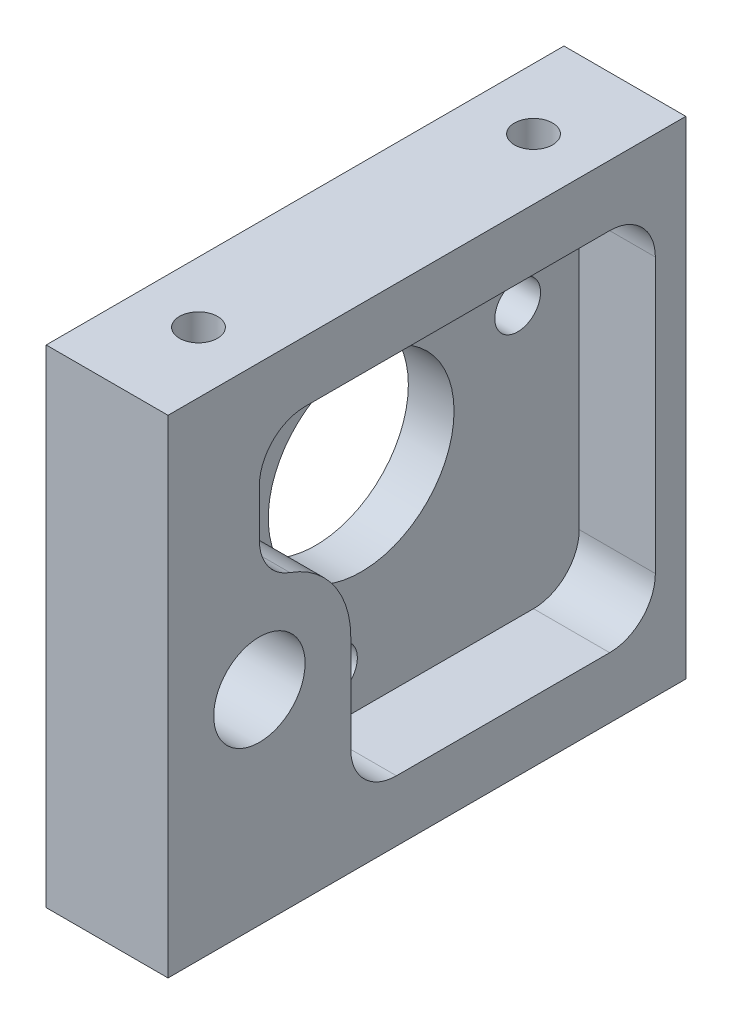
ISO-10303-21;
HEADER;
FILE_DESCRIPTION(('STEP AP214'),'2;1');
FILE_NAME('part.step','',(''),(''),'','','');
FILE_SCHEMA(('AUTOMOTIVE_DESIGN { 1 0 10303 214 1 1 1 1 }'));
ENDSEC;
DATA;
#1=APPLICATION_CONTEXT('core data for automotive mechanical design processes');
#2=APPLICATION_PROTOCOL_DEFINITION('international standard','automotive_design',2000,#1);
#3=PRODUCT_CONTEXT('',#1,'mechanical');
#4=PRODUCT('Part','Part','',(#3));
#5=PRODUCT_RELATED_PRODUCT_CATEGORY('part','',(#4));
#6=PRODUCT_DEFINITION_FORMATION('','',#4);
#7=PRODUCT_DEFINITION_CONTEXT('part definition',#1,'design');
#8=PRODUCT_DEFINITION('design','',#6,#7);
#9=PRODUCT_DEFINITION_SHAPE('','',#8);
#10=(LENGTH_UNIT() NAMED_UNIT(*) SI_UNIT(.MILLI.,.METRE.));
#11=(NAMED_UNIT(*) PLANE_ANGLE_UNIT() SI_UNIT($,.RADIAN.));
#12=(NAMED_UNIT(*) SI_UNIT($,.STERADIAN.) SOLID_ANGLE_UNIT());
#13=UNCERTAINTY_MEASURE_WITH_UNIT(LENGTH_MEASURE(1.E-05),#10,'distance_accuracy_value','');
#14=(GEOMETRIC_REPRESENTATION_CONTEXT(3) GLOBAL_UNCERTAINTY_ASSIGNED_CONTEXT((#13)) GLOBAL_UNIT_ASSIGNED_CONTEXT((#10,
#11,#12)) REPRESENTATION_CONTEXT('',''));
#15=CARTESIAN_POINT('',(0.,0.,0.));
#16=DIRECTION('',(0.,0.,1.));
#17=DIRECTION('',(1.,0.,0.));
#18=AXIS2_PLACEMENT_3D('',#15,#16,#17);
#19=CARTESIAN_POINT('',(-0.000999999999999265,6.98982565886287,-15.9327571658744));
#20=DIRECTION('',(1.,0.,0.));
#21=DIRECTION('',(0.,-0.866025403784443,0.499999999999992));
#22=AXIS2_PLACEMENT_3D('',#19,#20,#21);
#23=CYLINDRICAL_SURFACE('',#22,1.50000000000001);
#24=CARTESIAN_POINT('',(0.,6.98982565886287,-15.9327571658744));
#25=DIRECTION('',(-1.,0.,0.));
#26=DIRECTION('',(0.,0.866025403784443,-0.499999999999992));
#27=AXIS2_PLACEMENT_3D('',#24,#25,#26);
#28=CIRCLE('',#27,1.50000000000001);
#29=CARTESIAN_POINT('',(0.,8.28886376453955,-16.6827571658744));
#30=VERTEX_POINT('',#29);
#31=EDGE_CURVE('E11',#30,#30,#28,.F.);
#32=ORIENTED_EDGE('',*,*,#31,.F.);
#33=EDGE_LOOP('',(#32));
#34=FACE_BOUND('',#33,.T.);
#35=CARTESIAN_POINT('',(3.,6.98982565886287,-15.9327571658744));
#36=DIRECTION('',(1.,0.,0.));
#37=DIRECTION('',(0.,0.,-1.));
#38=AXIS2_PLACEMENT_3D('',#35,#36,#37);
#39=CIRCLE('',#38,1.50000000000001);
#40=CARTESIAN_POINT('',(3.,6.98982565886287,-17.4327571658744));
#41=VERTEX_POINT('',#40);
#42=EDGE_CURVE('E289',#41,#41,#39,.F.);
#43=ORIENTED_EDGE('',*,*,#42,.F.);
#44=EDGE_LOOP('',(#43));
#45=FACE_BOUND('',#44,.T.);
#46=ADVANCED_FACE('F37',(#34,#45),#23,.F.);
#47=CARTESIAN_POINT('',(-0.000999999999999265,24.7941743411371,-9.15004620343456));
#48=DIRECTION('',(1.,0.,0.));
#49=DIRECTION('',(0.,0.866025403784436,0.500000000000004));
#50=AXIS2_PLACEMENT_3D('',#47,#48,#49);
#51=CYLINDRICAL_SURFACE('',#50,1.50000000000001);
#52=CARTESIAN_POINT('',(0.,24.7941743411371,-9.15004620343456));
#53=DIRECTION('',(-1.,0.,0.));
#54=DIRECTION('',(0.,-0.866025403784436,-0.500000000000004));
#55=AXIS2_PLACEMENT_3D('',#52,#53,#54);
#56=CIRCLE('',#55,1.50000000000001);
#57=CARTESIAN_POINT('',(0.,23.4951362354604,-9.90004620343457));
#58=VERTEX_POINT('',#57);
#59=EDGE_CURVE('E45',#58,#58,#56,.F.);
#60=ORIENTED_EDGE('',*,*,#59,.F.);
#61=EDGE_LOOP('',(#60));
#62=FACE_BOUND('',#61,.T.);
#63=CARTESIAN_POINT('',(3.,24.7941743411371,-9.15004620343456));
#64=DIRECTION('',(1.,0.,0.));
#65=DIRECTION('',(0.,0.,-1.));
#66=AXIS2_PLACEMENT_3D('',#63,#64,#65);
#67=CIRCLE('',#66,1.50000000000001);
#68=CARTESIAN_POINT('',(3.,24.7941743411371,-10.6500462034346));
#69=VERTEX_POINT('',#68);
#70=EDGE_CURVE('E286',#69,#69,#67,.F.);
#71=ORIENTED_EDGE('',*,*,#70,.F.);
#72=EDGE_LOOP('',(#71));
#73=FACE_BOUND('',#72,.T.);
#74=ADVANCED_FACE('F333',(#62,#73),#51,.F.);
#75=CARTESIAN_POINT('',(-0.000999999999999265,17.85,-17.6810744368829));
#76=DIRECTION('',(1.,0.,0.));
#77=DIRECTION('',(0.,0.,-1.));
#78=AXIS2_PLACEMENT_3D('',#75,#76,#77);
#79=CYLINDRICAL_SURFACE('',#78,6.10000000000001);
#80=CARTESIAN_POINT('',(0.,17.85,-17.6810744368829));
#81=DIRECTION('',(-1.,0.,0.));
#82=DIRECTION('',(0.,0.,1.));
#83=AXIS2_PLACEMENT_3D('',#80,#81,#82);
#84=CIRCLE('',#83,6.10000000000001);
#85=CARTESIAN_POINT('',(0.,17.85,-11.5810744368829));
#86=VERTEX_POINT('',#85);
#87=EDGE_CURVE('E299',#86,#86,#84,.F.);
#88=ORIENTED_EDGE('',*,*,#87,.F.);
#89=EDGE_LOOP('',(#88));
#90=FACE_BOUND('',#89,.T.);
#91=CARTESIAN_POINT('',(3.,17.85,-17.6810744368829));
#92=DIRECTION('',(1.,0.,0.));
#93=DIRECTION('',(0.,0.,-1.));
#94=AXIS2_PLACEMENT_3D('',#91,#92,#93);
#95=CIRCLE('',#94,6.10000000000001);
#96=CARTESIAN_POINT('',(3.,17.85,-23.7810744368829));
#97=VERTEX_POINT('',#96);
#98=EDGE_CURVE('E283',#97,#97,#95,.F.);
#99=ORIENTED_EDGE('',*,*,#98,.F.);
#100=EDGE_LOOP('',(#99));
#101=FACE_BOUND('',#100,.T.);
#102=ADVANCED_FACE('F336',(#90,#101),#79,.F.);
#103=CARTESIAN_POINT('',(-0.000999999999999265,21.766,-27.9604199413399));
#104=DIRECTION('',(1.,0.,0.));
#105=DIRECTION('',(0.,0.,-1.));
#106=AXIS2_PLACEMENT_3D('',#103,#104,#105);
#107=CYLINDRICAL_SURFACE('',#106,1.50000000000001);
#108=CARTESIAN_POINT('',(0.,21.766,-27.9604199413399));
#109=DIRECTION('',(-1.,0.,0.));
#110=DIRECTION('',(0.,0.,1.));
#111=AXIS2_PLACEMENT_3D('',#108,#109,#110);
#112=CIRCLE('',#111,1.50000000000001);
#113=CARTESIAN_POINT('',(0.,21.766,-26.4604199413399));
#114=VERTEX_POINT('',#113);
#115=EDGE_CURVE('E292',#114,#114,#112,.F.);
#116=ORIENTED_EDGE('',*,*,#115,.F.);
#117=EDGE_LOOP('',(#116));
#118=FACE_BOUND('',#117,.T.);
#119=CARTESIAN_POINT('',(3.,21.766,-27.9604199413399));
#120=DIRECTION('',(1.,0.,0.));
#121=DIRECTION('',(0.,0.,-1.));
#122=AXIS2_PLACEMENT_3D('',#119,#120,#121);
#123=CIRCLE('',#122,1.50000000000001);
#124=CARTESIAN_POINT('',(3.,21.766,-29.4604199413399));
#125=VERTEX_POINT('',#124);
#126=EDGE_CURVE('E40',#125,#125,#123,.F.);
#127=ORIENTED_EDGE('',*,*,#126,.F.);
#128=EDGE_LOOP('',(#127));
#129=FACE_BOUND('',#128,.T.);
#130=ADVANCED_FACE('F387',(#118,#129),#107,.F.);
#131=CARTESIAN_POINT('',(8.,0.,0.));
#132=DIRECTION('',(0.,0.,-1.));
#133=DIRECTION('',(-1.,0.,0.));
#134=AXIS2_PLACEMENT_3D('',#131,#132,#133);
#135=PLANE('',#134);
#136=DIRECTION('',(0.,-1.,0.));
#137=VECTOR('',#136,1.);
#138=CARTESIAN_POINT('',(0.,0.,0.));
#139=LINE('',#138,#137);
#140=CARTESIAN_POINT('',(0.,32.,0.));
#141=VERTEX_POINT('',#140);
#142=CARTESIAN_POINT('',(0.,0.,0.));
#143=VERTEX_POINT('',#142);
#144=EDGE_CURVE('E304',#141,#143,#139,.T.);
#145=ORIENTED_EDGE('',*,*,#144,.T.);
#146=DIRECTION('',(-1.,0.,0.));
#147=VECTOR('',#146,1.);
#148=CARTESIAN_POINT('',(8.,0.,0.));
#149=LINE('',#148,#147);
#150=CARTESIAN_POINT('',(8.,0.,0.));
#151=VERTEX_POINT('',#150);
#152=EDGE_CURVE('E325',#151,#143,#149,.T.);
#153=ORIENTED_EDGE('',*,*,#152,.F.);
#154=DIRECTION('',(0.,-1.,0.));
#155=VECTOR('',#154,1.);
#156=CARTESIAN_POINT('',(8.,0.,0.));
#157=LINE('',#156,#155);
#158=CARTESIAN_POINT('',(8.,32.,0.));
#159=VERTEX_POINT('',#158);
#160=EDGE_CURVE('E305',#159,#151,#157,.T.);
#161=ORIENTED_EDGE('',*,*,#160,.F.);
#162=DIRECTION('',(-1.,0.,0.));
#163=VECTOR('',#162,1.);
#164=CARTESIAN_POINT('',(8.,32.,0.));
#165=LINE('',#164,#163);
#166=EDGE_CURVE('E311',#159,#141,#165,.T.);
#167=ORIENTED_EDGE('',*,*,#166,.T.);
#168=EDGE_LOOP('',(#145,#153,#161,#167));
#169=FACE_BOUND('',#168,.T.);
#170=ADVANCED_FACE('F384',(#169),#135,.F.);
#171=CARTESIAN_POINT('',(8.,0.,0.));
#172=DIRECTION('',(0.,1.,0.));
#173=DIRECTION('',(0.,0.,1.));
#174=AXIS2_PLACEMENT_3D('',#171,#172,#173);
#175=PLANE('',#174);
#176=CARTESIAN_POINT('',(4.,0.,-6.));
#177=DIRECTION('',(0.,-1.,0.));
#178=DIRECTION('',(0.,0.,-1.));
#179=AXIS2_PLACEMENT_3D('',#176,#177,#178);
#180=CIRCLE('',#179,1.24999999999999);
#181=CARTESIAN_POINT('',(4.,0.,-7.24999999999999));
#182=VERTEX_POINT('',#181);
#183=EDGE_CURVE('E175',#182,#182,#180,.T.);
#184=ORIENTED_EDGE('',*,*,#183,.F.);
#185=EDGE_LOOP('',(#184));
#186=FACE_BOUND('',#185,.T.);
#187=CARTESIAN_POINT('',(4.,0.,-28.));
#188=DIRECTION('',(0.,-1.,0.));
#189=DIRECTION('',(0.,0.,-1.));
#190=AXIS2_PLACEMENT_3D('',#187,#188,#189);
#191=CIRCLE('',#190,1.24999999999999);
#192=CARTESIAN_POINT('',(4.,0.,-29.25));
#193=VERTEX_POINT('',#192);
#194=EDGE_CURVE('E174',#193,#193,#191,.T.);
#195=ORIENTED_EDGE('',*,*,#194,.F.);
#196=EDGE_LOOP('',(#195));
#197=FACE_BOUND('',#196,.T.);
#198=DIRECTION('',(0.,0.,-1.));
#199=VECTOR('',#198,1.);
#200=CARTESIAN_POINT('',(0.,0.,0.));
#201=LINE('',#200,#199);
#202=CARTESIAN_POINT('',(0.,0.,-34.));
#203=VERTEX_POINT('',#202);
#204=EDGE_CURVE('E314',#143,#203,#201,.T.);
#205=ORIENTED_EDGE('',*,*,#204,.T.);
#206=DIRECTION('',(-1.,0.,0.));
#207=VECTOR('',#206,1.);
#208=CARTESIAN_POINT('',(8.,0.,-34.));
#209=LINE('',#208,#207);
#210=CARTESIAN_POINT('',(8.,0.,-34.));
#211=VERTEX_POINT('',#210);
#212=EDGE_CURVE('E322',#211,#203,#209,.T.);
#213=ORIENTED_EDGE('',*,*,#212,.F.);
#214=DIRECTION('',(0.,0.,-1.));
#215=VECTOR('',#214,1.);
#216=CARTESIAN_POINT('',(8.,0.,0.));
#217=LINE('',#216,#215);
#218=EDGE_CURVE('E90',#151,#211,#217,.T.);
#219=ORIENTED_EDGE('',*,*,#218,.F.);
#220=ORIENTED_EDGE('',*,*,#152,.T.);
#221=EDGE_LOOP('',(#205,#213,#219,#220));
#222=FACE_BOUND('',#221,.T.);
#223=ADVANCED_FACE('F380',(#186,#197,#222),#175,.F.);
#224=CARTESIAN_POINT('',(8.,0.,-34.));
#225=DIRECTION('',(0.,0.,1.));
#226=DIRECTION('',(1.,0.,0.));
#227=AXIS2_PLACEMENT_3D('',#224,#225,#226);
#228=PLANE('',#227);
#229=DIRECTION('',(0.,1.,0.));
#230=VECTOR('',#229,1.);
#231=CARTESIAN_POINT('',(0.,0.,-34.));
#232=LINE('',#231,#230);
#233=CARTESIAN_POINT('',(0.,32.,-34.));
#234=VERTEX_POINT('',#233);
#235=EDGE_CURVE('E316',#203,#234,#232,.T.);
#236=ORIENTED_EDGE('',*,*,#235,.T.);
#237=DIRECTION('',(-1.,0.,0.));
#238=VECTOR('',#237,1.);
#239=CARTESIAN_POINT('',(8.,32.,-34.));
#240=LINE('',#239,#238);
#241=CARTESIAN_POINT('',(8.,32.,-34.));
#242=VERTEX_POINT('',#241);
#243=EDGE_CURVE('E320',#242,#234,#240,.T.);
#244=ORIENTED_EDGE('',*,*,#243,.F.);
#245=DIRECTION('',(0.,1.,0.));
#246=VECTOR('',#245,1.);
#247=CARTESIAN_POINT('',(8.,0.,-34.));
#248=LINE('',#247,#246);
#249=EDGE_CURVE('E308',#211,#242,#248,.T.);
#250=ORIENTED_EDGE('',*,*,#249,.F.);
#251=ORIENTED_EDGE('',*,*,#212,.T.);
#252=EDGE_LOOP('',(#236,#244,#250,#251));
#253=FACE_BOUND('',#252,.T.);
#254=ADVANCED_FACE('F376',(#253),#228,.F.);
#255=CARTESIAN_POINT('',(8.,32.,0.));
#256=DIRECTION('',(0.,-1.,0.));
#257=DIRECTION('',(0.,0.,-1.));
#258=AXIS2_PLACEMENT_3D('',#255,#256,#257);
#259=PLANE('',#258);
#260=CARTESIAN_POINT('',(4.,32.,-6.));
#261=DIRECTION('',(0.,1.,0.));
#262=DIRECTION('',(0.,0.,1.));
#263=AXIS2_PLACEMENT_3D('',#260,#261,#262);
#264=CIRCLE('',#263,1.24999999999999);
#265=CARTESIAN_POINT('',(4.,32.,-4.75000000000001));
#266=VERTEX_POINT('',#265);
#267=EDGE_CURVE('E185',#266,#266,#264,.T.);
#268=ORIENTED_EDGE('',*,*,#267,.F.);
#269=EDGE_LOOP('',(#268));
#270=FACE_BOUND('',#269,.T.);
#271=CARTESIAN_POINT('',(4.,32.,-28.));
#272=DIRECTION('',(0.,1.,0.));
#273=DIRECTION('',(0.,0.,1.));
#274=AXIS2_PLACEMENT_3D('',#271,#272,#273);
#275=CIRCLE('',#274,1.24999999999999);
#276=CARTESIAN_POINT('',(4.,32.,-26.75));
#277=VERTEX_POINT('',#276);
#278=EDGE_CURVE('E191',#277,#277,#275,.T.);
#279=ORIENTED_EDGE('',*,*,#278,.F.);
#280=EDGE_LOOP('',(#279));
#281=FACE_BOUND('',#280,.T.);
#282=DIRECTION('',(0.,0.,1.));
#283=VECTOR('',#282,1.);
#284=CARTESIAN_POINT('',(0.,32.,0.));
#285=LINE('',#284,#283);
#286=EDGE_CURVE('E82',#234,#141,#285,.T.);
#287=ORIENTED_EDGE('',*,*,#286,.T.);
#288=ORIENTED_EDGE('',*,*,#166,.F.);
#289=DIRECTION('',(0.,0.,1.));
#290=VECTOR('',#289,1.);
#291=CARTESIAN_POINT('',(8.,32.,0.));
#292=LINE('',#291,#290);
#293=EDGE_CURVE('E61',#242,#159,#292,.T.);
#294=ORIENTED_EDGE('',*,*,#293,.F.);
#295=ORIENTED_EDGE('',*,*,#243,.T.);
#296=EDGE_LOOP('',(#287,#288,#294,#295));
#297=FACE_BOUND('',#296,.T.);
#298=ADVANCED_FACE('F369',(#270,#281,#297),#259,.F.);
#299=CARTESIAN_POINT('',(8.,0.,0.));
#300=DIRECTION('',(-1.,0.,0.));
#301=DIRECTION('',(0.,0.,1.));
#302=AXIS2_PLACEMENT_3D('',#299,#300,#301);
#303=PLANE('',#302);
#304=DIRECTION('',(0.,-1.,0.));
#305=VECTOR('',#304,1.);
#306=CARTESIAN_POINT('',(8.,7.,-12.));
#307=LINE('',#306,#305);
#308=CARTESIAN_POINT('',(8.,13.4,-12.));
#309=VERTEX_POINT('',#308);
#310=CARTESIAN_POINT('',(8.,7.,-12.));
#311=VERTEX_POINT('',#310);
#312=EDGE_CURVE('E233',#309,#311,#307,.T.);
#313=ORIENTED_EDGE('',*,*,#312,.F.);
#314=CARTESIAN_POINT('',(8.,13.4,-6.));
#315=DIRECTION('',(-1.,0.,0.));
#316=DIRECTION('',(0.,0.,-1.));
#317=AXIS2_PLACEMENT_3D('',#314,#315,#316);
#318=CIRCLE('',#317,6.);
#319=CARTESIAN_POINT('',(8.,19.0568542494924,-8.));
#320=VERTEX_POINT('',#319);
#321=EDGE_CURVE('E52',#320,#309,#318,.T.);
#322=ORIENTED_EDGE('',*,*,#321,.F.);
#323=CARTESIAN_POINT('',(8.,21.8852813742386,-9.));
#324=DIRECTION('',(1.,0.,0.));
#325=DIRECTION('',(0.,0.,1.));
#326=AXIS2_PLACEMENT_3D('',#323,#324,#325);
#327=CIRCLE('',#326,3.);
#328=CARTESIAN_POINT('',(8.,21.8852813742386,-6.));
#329=VERTEX_POINT('',#328);
#330=EDGE_CURVE('E201',#329,#320,#327,.T.);
#331=ORIENTED_EDGE('',*,*,#330,.F.);
#332=DIRECTION('',(0.,-1.,0.));
#333=VECTOR('',#332,1.);
#334=CARTESIAN_POINT('',(8.,21.8852813742386,-6.));
#335=LINE('',#334,#333);
#336=CARTESIAN_POINT('',(8.,25.,-6.));
#337=VERTEX_POINT('',#336);
#338=EDGE_CURVE('E257',#337,#329,#335,.T.);
#339=ORIENTED_EDGE('',*,*,#338,.F.);
#340=CARTESIAN_POINT('',(8.,25.,-9.));
#341=DIRECTION('',(1.,0.,0.));
#342=DIRECTION('',(0.,0.,1.));
#343=AXIS2_PLACEMENT_3D('',#340,#341,#342);
#344=CIRCLE('',#343,3.);
#345=CARTESIAN_POINT('',(8.,28.,-9.));
#346=VERTEX_POINT('',#345);
#347=EDGE_CURVE('E254',#346,#337,#344,.T.);
#348=ORIENTED_EDGE('',*,*,#347,.F.);
#349=DIRECTION('',(0.,0.,1.));
#350=VECTOR('',#349,1.);
#351=CARTESIAN_POINT('',(8.,28.,-9.));
#352=LINE('',#351,#350);
#353=CARTESIAN_POINT('',(8.,28.,-29.));
#354=VERTEX_POINT('',#353);
#355=EDGE_CURVE('E251',#354,#346,#352,.T.);
#356=ORIENTED_EDGE('',*,*,#355,.F.);
#357=CARTESIAN_POINT('',(8.,25.,-29.));
#358=DIRECTION('',(1.,0.,0.));
#359=DIRECTION('',(0.,0.,-1.));
#360=AXIS2_PLACEMENT_3D('',#357,#358,#359);
#361=CIRCLE('',#360,3.);
#362=CARTESIAN_POINT('',(8.,25.,-32.));
#363=VERTEX_POINT('',#362);
#364=EDGE_CURVE('E248',#363,#354,#361,.T.);
#365=ORIENTED_EDGE('',*,*,#364,.F.);
#366=DIRECTION('',(0.,1.,0.));
#367=VECTOR('',#366,1.);
#368=CARTESIAN_POINT('',(8.,25.,-32.));
#369=LINE('',#368,#367);
#370=CARTESIAN_POINT('',(8.,7.00000000000002,-32.));
#371=VERTEX_POINT('',#370);
#372=EDGE_CURVE('E245',#371,#363,#369,.T.);
#373=ORIENTED_EDGE('',*,*,#372,.F.);
#374=CARTESIAN_POINT('',(8.,7.,-29.));
#375=DIRECTION('',(1.,0.,0.));
#376=DIRECTION('',(0.,0.,1.));
#377=AXIS2_PLACEMENT_3D('',#374,#375,#376);
#378=CIRCLE('',#377,3.);
#379=CARTESIAN_POINT('',(8.,4.,-29.));
#380=VERTEX_POINT('',#379);
#381=EDGE_CURVE('E242',#380,#371,#378,.T.);
#382=ORIENTED_EDGE('',*,*,#381,.F.);
#383=DIRECTION('',(0.,0.,-1.));
#384=VECTOR('',#383,1.);
#385=CARTESIAN_POINT('',(8.,4.,-29.));
#386=LINE('',#385,#384);
#387=CARTESIAN_POINT('',(8.,4.,-15.));
#388=VERTEX_POINT('',#387);
#389=EDGE_CURVE('E239',#388,#380,#386,.T.);
#390=ORIENTED_EDGE('',*,*,#389,.F.);
#391=CARTESIAN_POINT('',(8.,7.,-15.));
#392=DIRECTION('',(1.,0.,0.));
#393=DIRECTION('',(0.,0.,1.));
#394=AXIS2_PLACEMENT_3D('',#391,#392,#393);
#395=CIRCLE('',#394,3.);
#396=EDGE_CURVE('E236',#311,#388,#395,.T.);
#397=ORIENTED_EDGE('',*,*,#396,.F.);
#398=EDGE_LOOP('',(#313,#322,#331,#339,#348,#356,#365,#373,#382,#390,#397));
#399=FACE_BOUND('',#398,.T.);
#400=CARTESIAN_POINT('',(8.,13.4,-6.));
#401=DIRECTION('',(1.,0.,0.));
#402=DIRECTION('',(0.,0.,-1.));
#403=AXIS2_PLACEMENT_3D('',#400,#401,#402);
#404=CIRCLE('',#403,3.);
#405=CARTESIAN_POINT('',(8.,13.4,-9.));
#406=VERTEX_POINT('',#405);
#407=EDGE_CURVE('E296',#406,#406,#404,.T.);
#408=ORIENTED_EDGE('',*,*,#407,.F.);
#409=EDGE_LOOP('',(#408));
#410=FACE_BOUND('',#409,.T.);
#411=ORIENTED_EDGE('',*,*,#160,.T.);
#412=ORIENTED_EDGE('',*,*,#218,.T.);
#413=ORIENTED_EDGE('',*,*,#249,.T.);
#414=ORIENTED_EDGE('',*,*,#293,.T.);
#415=EDGE_LOOP('',(#411,#412,#413,#414));
#416=FACE_BOUND('',#415,.T.);
#417=ADVANCED_FACE('F361',(#399,#410,#416),#303,.F.);
#418=CARTESIAN_POINT('',(0.,0.,0.));
#419=DIRECTION('',(-1.,0.,0.));
#420=DIRECTION('',(0.,0.,1.));
#421=AXIS2_PLACEMENT_3D('',#418,#419,#420);
#422=PLANE('',#421);
#423=ORIENTED_EDGE('',*,*,#31,.T.);
#424=EDGE_LOOP('',(#423));
#425=FACE_BOUND('',#424,.T.);
#426=ORIENTED_EDGE('',*,*,#59,.T.);
#427=EDGE_LOOP('',(#426));
#428=FACE_BOUND('',#427,.T.);
#429=ORIENTED_EDGE('',*,*,#115,.T.);
#430=EDGE_LOOP('',(#429));
#431=FACE_BOUND('',#430,.T.);
#432=CARTESIAN_POINT('',(0.,13.4,-6.));
#433=DIRECTION('',(-1.,0.,0.));
#434=DIRECTION('',(0.,0.,1.));
#435=AXIS2_PLACEMENT_3D('',#432,#433,#434);
#436=CIRCLE('',#435,3.);
#437=CARTESIAN_POINT('',(0.,13.4,-3.));
#438=VERTEX_POINT('',#437);
#439=EDGE_CURVE('E295',#438,#438,#436,.F.);
#440=ORIENTED_EDGE('',*,*,#439,.T.);
#441=EDGE_LOOP('',(#440));
#442=FACE_BOUND('',#441,.T.);
#443=ORIENTED_EDGE('',*,*,#87,.T.);
#444=EDGE_LOOP('',(#443));
#445=FACE_BOUND('',#444,.T.);
#446=ORIENTED_EDGE('',*,*,#144,.F.);
#447=ORIENTED_EDGE('',*,*,#286,.F.);
#448=ORIENTED_EDGE('',*,*,#235,.F.);
#449=ORIENTED_EDGE('',*,*,#204,.F.);
#450=EDGE_LOOP('',(#446,#447,#448,#449));
#451=FACE_BOUND('',#450,.T.);
#452=ADVANCED_FACE('F330',(#425,#428,#431,#442,#445,#451),#422,.T.);
#453=CARTESIAN_POINT('',(-0.000999999999999265,13.4,-6.));
#454=DIRECTION('',(1.,0.,0.));
#455=DIRECTION('',(0.,0.,-1.));
#456=AXIS2_PLACEMENT_3D('',#453,#454,#455);
#457=CYLINDRICAL_SURFACE('',#456,3.);
#458=ORIENTED_EDGE('',*,*,#439,.F.);
#459=EDGE_LOOP('',(#458));
#460=FACE_BOUND('',#459,.T.);
#461=ORIENTED_EDGE('',*,*,#407,.T.);
#462=EDGE_LOOP('',(#461));
#463=FACE_BOUND('',#462,.T.);
#464=ADVANCED_FACE('F343',(#460,#463),#457,.F.);
#465=CARTESIAN_POINT('',(3.,13.4,-6.));
#466=DIRECTION('',(1.,0.,0.));
#467=DIRECTION('',(0.,0.,-1.));
#468=AXIS2_PLACEMENT_3D('',#465,#466,#467);
#469=PLANE('',#468);
#470=ORIENTED_EDGE('',*,*,#70,.T.);
#471=EDGE_LOOP('',(#470));
#472=FACE_BOUND('',#471,.T.);
#473=ORIENTED_EDGE('',*,*,#126,.T.);
#474=EDGE_LOOP('',(#473));
#475=FACE_BOUND('',#474,.T.);
#476=CARTESIAN_POINT('',(3.,13.4,-6.));
#477=DIRECTION('',(-1.,0.,0.));
#478=DIRECTION('',(0.,0.,-1.));
#479=AXIS2_PLACEMENT_3D('',#476,#477,#478);
#480=CIRCLE('',#479,6.);
#481=CARTESIAN_POINT('',(3.,19.0568542494924,-8.));
#482=VERTEX_POINT('',#481);
#483=CARTESIAN_POINT('',(3.,13.4,-12.));
#484=VERTEX_POINT('',#483);
#485=EDGE_CURVE('E197',#482,#484,#480,.T.);
#486=ORIENTED_EDGE('',*,*,#485,.T.);
#487=DIRECTION('',(0.,-1.,0.));
#488=VECTOR('',#487,1.);
#489=CARTESIAN_POINT('',(3.,7.,-12.));
#490=LINE('',#489,#488);
#491=CARTESIAN_POINT('',(3.,7.,-12.));
#492=VERTEX_POINT('',#491);
#493=EDGE_CURVE('E200',#484,#492,#490,.T.);
#494=ORIENTED_EDGE('',*,*,#493,.T.);
#495=CARTESIAN_POINT('',(3.,7.,-15.));
#496=DIRECTION('',(1.,0.,0.));
#497=DIRECTION('',(0.,0.,1.));
#498=AXIS2_PLACEMENT_3D('',#495,#496,#497);
#499=CIRCLE('',#498,3.);
#500=CARTESIAN_POINT('',(3.,4.,-15.));
#501=VERTEX_POINT('',#500);
#502=EDGE_CURVE('E204',#492,#501,#499,.T.);
#503=ORIENTED_EDGE('',*,*,#502,.T.);
#504=DIRECTION('',(0.,0.,-1.));
#505=VECTOR('',#504,1.);
#506=CARTESIAN_POINT('',(3.,4.,-29.));
#507=LINE('',#506,#505);
#508=CARTESIAN_POINT('',(3.,4.,-29.));
#509=VERTEX_POINT('',#508);
#510=EDGE_CURVE('E207',#501,#509,#507,.T.);
#511=ORIENTED_EDGE('',*,*,#510,.T.);
#512=CARTESIAN_POINT('',(3.,7.,-29.));
#513=DIRECTION('',(1.,0.,0.));
#514=DIRECTION('',(0.,0.,1.));
#515=AXIS2_PLACEMENT_3D('',#512,#513,#514);
#516=CIRCLE('',#515,3.);
#517=CARTESIAN_POINT('',(3.,7.00000000000002,-32.));
#518=VERTEX_POINT('',#517);
#519=EDGE_CURVE('E210',#509,#518,#516,.T.);
#520=ORIENTED_EDGE('',*,*,#519,.T.);
#521=DIRECTION('',(0.,1.,0.));
#522=VECTOR('',#521,1.);
#523=CARTESIAN_POINT('',(3.,25.,-32.));
#524=LINE('',#523,#522);
#525=CARTESIAN_POINT('',(3.,25.,-32.));
#526=VERTEX_POINT('',#525);
#527=EDGE_CURVE('E213',#518,#526,#524,.T.);
#528=ORIENTED_EDGE('',*,*,#527,.T.);
#529=CARTESIAN_POINT('',(3.,25.,-29.));
#530=DIRECTION('',(1.,0.,0.));
#531=DIRECTION('',(0.,0.,-1.));
#532=AXIS2_PLACEMENT_3D('',#529,#530,#531);
#533=CIRCLE('',#532,3.);
#534=CARTESIAN_POINT('',(3.,28.,-29.));
#535=VERTEX_POINT('',#534);
#536=EDGE_CURVE('E216',#526,#535,#533,.T.);
#537=ORIENTED_EDGE('',*,*,#536,.T.);
#538=DIRECTION('',(0.,0.,1.));
#539=VECTOR('',#538,1.);
#540=CARTESIAN_POINT('',(3.,28.,-9.));
#541=LINE('',#540,#539);
#542=CARTESIAN_POINT('',(3.,28.,-9.));
#543=VERTEX_POINT('',#542);
#544=EDGE_CURVE('E219',#535,#543,#541,.T.);
#545=ORIENTED_EDGE('',*,*,#544,.T.);
#546=CARTESIAN_POINT('',(3.,25.,-9.));
#547=DIRECTION('',(1.,0.,0.));
#548=DIRECTION('',(0.,0.,1.));
#549=AXIS2_PLACEMENT_3D('',#546,#547,#548);
#550=CIRCLE('',#549,3.);
#551=CARTESIAN_POINT('',(3.,25.,-6.));
#552=VERTEX_POINT('',#551);
#553=EDGE_CURVE('E222',#543,#552,#550,.T.);
#554=ORIENTED_EDGE('',*,*,#553,.T.);
#555=DIRECTION('',(0.,-1.,0.));
#556=VECTOR('',#555,1.);
#557=CARTESIAN_POINT('',(3.,21.8852813742386,-6.));
#558=LINE('',#557,#556);
#559=CARTESIAN_POINT('',(3.,21.8852813742386,-6.));
#560=VERTEX_POINT('',#559);
#561=EDGE_CURVE('E225',#552,#560,#558,.T.);
#562=ORIENTED_EDGE('',*,*,#561,.T.);
#563=CARTESIAN_POINT('',(3.,21.8852813742386,-9.));
#564=DIRECTION('',(1.,0.,0.));
#565=DIRECTION('',(0.,0.,1.));
#566=AXIS2_PLACEMENT_3D('',#563,#564,#565);
#567=CIRCLE('',#566,3.);
#568=EDGE_CURVE('E228',#560,#482,#567,.T.);
#569=ORIENTED_EDGE('',*,*,#568,.T.);
#570=EDGE_LOOP('',(#486,#494,#503,#511,#520,#528,#537,#545,#554,#562,#569));
#571=FACE_BOUND('',#570,.T.);
#572=ORIENTED_EDGE('',*,*,#98,.T.);
#573=EDGE_LOOP('',(#572));
#574=FACE_BOUND('',#573,.T.);
#575=ORIENTED_EDGE('',*,*,#42,.T.);
#576=EDGE_LOOP('',(#575));
#577=FACE_BOUND('',#576,.T.);
#578=ADVANCED_FACE('F339',(#472,#475,#571,#574,#577),#469,.T.);
#579=CARTESIAN_POINT('',(3.,13.4,-6.));
#580=DIRECTION('',(1.,0.,0.));
#581=DIRECTION('',(0.,0.,-1.));
#582=AXIS2_PLACEMENT_3D('',#579,#580,#581);
#583=CYLINDRICAL_SURFACE('',#582,6.);
#584=ORIENTED_EDGE('',*,*,#321,.T.);
#585=DIRECTION('',(1.,0.,0.));
#586=VECTOR('',#585,1.);
#587=CARTESIAN_POINT('',(3.,13.4,-12.));
#588=LINE('',#587,#586);
#589=EDGE_CURVE('E231',#484,#309,#588,.T.);
#590=ORIENTED_EDGE('',*,*,#589,.F.);
#591=ORIENTED_EDGE('',*,*,#485,.F.);
#592=DIRECTION('',(1.,0.,0.));
#593=VECTOR('',#592,1.);
#594=CARTESIAN_POINT('',(3.,19.0568542494924,-8.));
#595=LINE('',#594,#593);
#596=EDGE_CURVE('E262',#482,#320,#595,.T.);
#597=ORIENTED_EDGE('',*,*,#596,.T.);
#598=EDGE_LOOP('',(#584,#590,#591,#597));
#599=FACE_BOUND('',#598,.T.);
#600=ADVANCED_FACE('F342',(#599),#583,.T.);
#601=CARTESIAN_POINT('',(3.,21.8852813742386,-9.));
#602=DIRECTION('',(1.,0.,0.));
#603=DIRECTION('',(0.,0.,-1.));
#604=AXIS2_PLACEMENT_3D('',#601,#602,#603);
#605=CYLINDRICAL_SURFACE('',#604,3.);
#606=ORIENTED_EDGE('',*,*,#330,.T.);
#607=ORIENTED_EDGE('',*,*,#596,.F.);
#608=ORIENTED_EDGE('',*,*,#568,.F.);
#609=DIRECTION('',(1.,0.,0.));
#610=VECTOR('',#609,1.);
#611=CARTESIAN_POINT('',(3.,21.8852813742386,-6.));
#612=LINE('',#611,#610);
#613=EDGE_CURVE('E264',#560,#329,#612,.T.);
#614=ORIENTED_EDGE('',*,*,#613,.T.);
#615=EDGE_LOOP('',(#606,#607,#608,#614));
#616=FACE_BOUND('',#615,.T.);
#617=ADVANCED_FACE('F410',(#616),#605,.F.);
#618=CARTESIAN_POINT('',(3.,21.8852813742386,-6.));
#619=DIRECTION('',(0.,0.,1.));
#620=DIRECTION('',(0.,-1.,0.));
#621=AXIS2_PLACEMENT_3D('',#618,#619,#620);
#622=PLANE('',#621);
#623=ORIENTED_EDGE('',*,*,#338,.T.);
#624=ORIENTED_EDGE('',*,*,#613,.F.);
#625=ORIENTED_EDGE('',*,*,#561,.F.);
#626=DIRECTION('',(1.,0.,0.));
#627=VECTOR('',#626,1.);
#628=CARTESIAN_POINT('',(3.,25.,-6.));
#629=LINE('',#628,#627);
#630=EDGE_CURVE('E266',#552,#337,#629,.T.);
#631=ORIENTED_EDGE('',*,*,#630,.T.);
#632=EDGE_LOOP('',(#623,#624,#625,#631));
#633=FACE_BOUND('',#632,.T.);
#634=ADVANCED_FACE('F443',(#633),#622,.F.);
#635=CARTESIAN_POINT('',(3.,25.,-9.));
#636=DIRECTION('',(1.,0.,0.));
#637=DIRECTION('',(0.,0.,-1.));
#638=AXIS2_PLACEMENT_3D('',#635,#636,#637);
#639=CYLINDRICAL_SURFACE('',#638,3.);
#640=ORIENTED_EDGE('',*,*,#347,.T.);
#641=ORIENTED_EDGE('',*,*,#630,.F.);
#642=ORIENTED_EDGE('',*,*,#553,.F.);
#643=DIRECTION('',(1.,0.,0.));
#644=VECTOR('',#643,1.);
#645=CARTESIAN_POINT('',(3.,28.,-9.));
#646=LINE('',#645,#644);
#647=EDGE_CURVE('E268',#543,#346,#646,.T.);
#648=ORIENTED_EDGE('',*,*,#647,.T.);
#649=EDGE_LOOP('',(#640,#641,#642,#648));
#650=FACE_BOUND('',#649,.T.);
#651=ADVANCED_FACE('F439',(#650),#639,.F.);
#652=CARTESIAN_POINT('',(3.,28.,-9.));
#653=DIRECTION('',(0.,1.,0.));
#654=DIRECTION('',(0.,0.,1.));
#655=AXIS2_PLACEMENT_3D('',#652,#653,#654);
#656=PLANE('',#655);
#657=ORIENTED_EDGE('',*,*,#355,.T.);
#658=ORIENTED_EDGE('',*,*,#647,.F.);
#659=ORIENTED_EDGE('',*,*,#544,.F.);
#660=DIRECTION('',(1.,0.,0.));
#661=VECTOR('',#660,1.);
#662=CARTESIAN_POINT('',(3.,28.,-29.));
#663=LINE('',#662,#661);
#664=EDGE_CURVE('E270',#535,#354,#663,.T.);
#665=ORIENTED_EDGE('',*,*,#664,.T.);
#666=EDGE_LOOP('',(#657,#658,#659,#665));
#667=FACE_BOUND('',#666,.T.);
#668=ADVANCED_FACE('F435',(#667),#656,.F.);
#669=CARTESIAN_POINT('',(3.,25.,-29.));
#670=DIRECTION('',(1.,0.,0.));
#671=DIRECTION('',(0.,0.,-1.));
#672=AXIS2_PLACEMENT_3D('',#669,#670,#671);
#673=CYLINDRICAL_SURFACE('',#672,3.);
#674=ORIENTED_EDGE('',*,*,#364,.T.);
#675=ORIENTED_EDGE('',*,*,#664,.F.);
#676=ORIENTED_EDGE('',*,*,#536,.F.);
#677=DIRECTION('',(1.,0.,0.));
#678=VECTOR('',#677,1.);
#679=CARTESIAN_POINT('',(3.,25.,-32.));
#680=LINE('',#679,#678);
#681=EDGE_CURVE('E272',#526,#363,#680,.T.);
#682=ORIENTED_EDGE('',*,*,#681,.T.);
#683=EDGE_LOOP('',(#674,#675,#676,#682));
#684=FACE_BOUND('',#683,.T.);
#685=ADVANCED_FACE('F431',(#684),#673,.F.);
#686=CARTESIAN_POINT('',(3.,25.,-32.));
#687=DIRECTION('',(0.,0.,-1.));
#688=DIRECTION('',(-1.,0.,0.));
#689=AXIS2_PLACEMENT_3D('',#686,#687,#688);
#690=PLANE('',#689);
#691=ORIENTED_EDGE('',*,*,#372,.T.);
#692=ORIENTED_EDGE('',*,*,#681,.F.);
#693=ORIENTED_EDGE('',*,*,#527,.F.);
#694=DIRECTION('',(1.,0.,0.));
#695=VECTOR('',#694,1.);
#696=CARTESIAN_POINT('',(3.,7.00000000000002,-32.));
#697=LINE('',#696,#695);
#698=EDGE_CURVE('E274',#518,#371,#697,.T.);
#699=ORIENTED_EDGE('',*,*,#698,.T.);
#700=EDGE_LOOP('',(#691,#692,#693,#699));
#701=FACE_BOUND('',#700,.T.);
#702=ADVANCED_FACE('F427',(#701),#690,.F.);
#703=CARTESIAN_POINT('',(3.,7.,-29.));
#704=DIRECTION('',(1.,0.,0.));
#705=DIRECTION('',(0.,0.,-1.));
#706=AXIS2_PLACEMENT_3D('',#703,#704,#705);
#707=CYLINDRICAL_SURFACE('',#706,3.);
#708=ORIENTED_EDGE('',*,*,#381,.T.);
#709=ORIENTED_EDGE('',*,*,#698,.F.);
#710=ORIENTED_EDGE('',*,*,#519,.F.);
#711=DIRECTION('',(1.,0.,0.));
#712=VECTOR('',#711,1.);
#713=CARTESIAN_POINT('',(3.,4.,-29.));
#714=LINE('',#713,#712);
#715=EDGE_CURVE('E276',#509,#380,#714,.T.);
#716=ORIENTED_EDGE('',*,*,#715,.T.);
#717=EDGE_LOOP('',(#708,#709,#710,#716));
#718=FACE_BOUND('',#717,.T.);
#719=ADVANCED_FACE('F423',(#718),#707,.F.);
#720=CARTESIAN_POINT('',(3.,4.,-29.));
#721=DIRECTION('',(0.,-1.,0.));
#722=DIRECTION('',(0.,0.,-1.));
#723=AXIS2_PLACEMENT_3D('',#720,#721,#722);
#724=PLANE('',#723);
#725=ORIENTED_EDGE('',*,*,#389,.T.);
#726=ORIENTED_EDGE('',*,*,#715,.F.);
#727=ORIENTED_EDGE('',*,*,#510,.F.);
#728=DIRECTION('',(1.,0.,0.));
#729=VECTOR('',#728,1.);
#730=CARTESIAN_POINT('',(3.,4.,-15.));
#731=LINE('',#730,#729);
#732=EDGE_CURVE('E278',#501,#388,#731,.T.);
#733=ORIENTED_EDGE('',*,*,#732,.T.);
#734=EDGE_LOOP('',(#725,#726,#727,#733));
#735=FACE_BOUND('',#734,.T.);
#736=ADVANCED_FACE('F419',(#735),#724,.F.);
#737=CARTESIAN_POINT('',(3.,7.,-15.));
#738=DIRECTION('',(1.,0.,0.));
#739=DIRECTION('',(0.,0.,-1.));
#740=AXIS2_PLACEMENT_3D('',#737,#738,#739);
#741=CYLINDRICAL_SURFACE('',#740,3.);
#742=ORIENTED_EDGE('',*,*,#396,.T.);
#743=ORIENTED_EDGE('',*,*,#732,.F.);
#744=ORIENTED_EDGE('',*,*,#502,.F.);
#745=DIRECTION('',(1.,0.,0.));
#746=VECTOR('',#745,1.);
#747=CARTESIAN_POINT('',(3.,7.,-12.));
#748=LINE('',#747,#746);
#749=EDGE_CURVE('E280',#492,#311,#748,.T.);
#750=ORIENTED_EDGE('',*,*,#749,.T.);
#751=EDGE_LOOP('',(#742,#743,#744,#750));
#752=FACE_BOUND('',#751,.T.);
#753=ADVANCED_FACE('F415',(#752),#741,.F.);
#754=CARTESIAN_POINT('',(3.,7.,-12.));
#755=DIRECTION('',(0.,0.,1.));
#756=DIRECTION('',(1.,0.,0.));
#757=AXIS2_PLACEMENT_3D('',#754,#755,#756);
#758=PLANE('',#757);
#759=ORIENTED_EDGE('',*,*,#312,.T.);
#760=ORIENTED_EDGE('',*,*,#749,.F.);
#761=ORIENTED_EDGE('',*,*,#493,.F.);
#762=ORIENTED_EDGE('',*,*,#589,.T.);
#763=EDGE_LOOP('',(#759,#760,#761,#762));
#764=FACE_BOUND('',#763,.T.);
#765=ADVANCED_FACE('F411',(#764),#758,.F.);
#766=CARTESIAN_POINT('',(4.,29.,-28.));
#767=DIRECTION('',(0.,1.,0.));
#768=DIRECTION('',(0.,0.,1.));
#769=AXIS2_PLACEMENT_3D('',#766,#767,#768);
#770=CONICAL_SURFACE('',#769,1.25,1.02974425867665);
#771=CARTESIAN_POINT('',(4.,28.2489242262155,-28.));
#772=VERTEX_POINT('',#771);
#773=VERTEX_LOOP('',#772);
#774=FACE_BOUND('',#773,.T.);
#775=CARTESIAN_POINT('',(4.,29.,-28.));
#776=DIRECTION('',(0.,1.,0.));
#777=DIRECTION('',(0.,0.,1.));
#778=AXIS2_PLACEMENT_3D('',#775,#776,#777);
#779=CIRCLE('',#778,1.25);
#780=CARTESIAN_POINT('',(4.,29.,-26.75));
#781=VERTEX_POINT('',#780);
#782=EDGE_CURVE('E194',#781,#781,#779,.T.);
#783=ORIENTED_EDGE('',*,*,#782,.T.);
#784=EDGE_LOOP('',(#783));
#785=FACE_BOUND('',#784,.T.);
#786=ADVANCED_FACE('F414',(#774,#785),#770,.F.);
#787=CARTESIAN_POINT('',(4.,32.,-28.));
#788=DIRECTION('',(0.,1.,0.));
#789=DIRECTION('',(0.,0.,1.));
#790=AXIS2_PLACEMENT_3D('',#787,#788,#789);
#791=CYLINDRICAL_SURFACE('',#790,1.24999999999999);
#792=ORIENTED_EDGE('',*,*,#782,.F.);
#793=EDGE_LOOP('',(#792));
#794=FACE_BOUND('',#793,.T.);
#795=ORIENTED_EDGE('',*,*,#278,.T.);
#796=EDGE_LOOP('',(#795));
#797=FACE_BOUND('',#796,.T.);
#798=ADVANCED_FACE('F453',(#794,#797),#791,.F.);
#799=CARTESIAN_POINT('',(4.,29.,-6.));
#800=DIRECTION('',(0.,1.,0.));
#801=DIRECTION('',(0.,0.,1.));
#802=AXIS2_PLACEMENT_3D('',#799,#800,#801);
#803=CONICAL_SURFACE('',#802,1.25,1.02974425867665);
#804=CARTESIAN_POINT('',(4.,28.2489242262155,-6.));
#805=VERTEX_POINT('',#804);
#806=VERTEX_LOOP('',#805);
#807=FACE_BOUND('',#806,.T.);
#808=CARTESIAN_POINT('',(4.,29.,-6.));
#809=DIRECTION('',(0.,1.,0.));
#810=DIRECTION('',(0.,0.,1.));
#811=AXIS2_PLACEMENT_3D('',#808,#809,#810);
#812=CIRCLE('',#811,1.25);
#813=CARTESIAN_POINT('',(4.,29.,-4.75));
#814=VERTEX_POINT('',#813);
#815=EDGE_CURVE('E188',#814,#814,#812,.T.);
#816=ORIENTED_EDGE('',*,*,#815,.T.);
#817=EDGE_LOOP('',(#816));
#818=FACE_BOUND('',#817,.T.);
#819=ADVANCED_FACE('F457',(#807,#818),#803,.F.);
#820=CARTESIAN_POINT('',(4.,32.,-6.));
#821=DIRECTION('',(0.,1.,0.));
#822=DIRECTION('',(0.,0.,1.));
#823=AXIS2_PLACEMENT_3D('',#820,#821,#822);
#824=CYLINDRICAL_SURFACE('',#823,1.24999999999999);
#825=ORIENTED_EDGE('',*,*,#815,.F.);
#826=EDGE_LOOP('',(#825));
#827=FACE_BOUND('',#826,.T.);
#828=ORIENTED_EDGE('',*,*,#267,.T.);
#829=EDGE_LOOP('',(#828));
#830=FACE_BOUND('',#829,.T.);
#831=ADVANCED_FACE('F461',(#827,#830),#824,.F.);
#832=CARTESIAN_POINT('',(4.,3.,-28.));
#833=DIRECTION('',(0.,-1.,0.));
#834=DIRECTION('',(0.,0.,-1.));
#835=AXIS2_PLACEMENT_3D('',#832,#833,#834);
#836=CONICAL_SURFACE('',#835,1.24999999999999,1.02974425867665);
#837=CARTESIAN_POINT('',(4.,3.75107577378445,-28.));
#838=VERTEX_POINT('',#837);
#839=VERTEX_LOOP('',#838);
#840=FACE_BOUND('',#839,.T.);
#841=CARTESIAN_POINT('',(4.,3.,-28.));
#842=DIRECTION('',(0.,-1.,0.));
#843=DIRECTION('',(0.,0.,-1.));
#844=AXIS2_PLACEMENT_3D('',#841,#842,#843);
#845=CIRCLE('',#844,1.24999999999999);
#846=CARTESIAN_POINT('',(4.,3.,-29.25));
#847=VERTEX_POINT('',#846);
#848=EDGE_CURVE('E178',#847,#847,#845,.T.);
#849=ORIENTED_EDGE('',*,*,#848,.T.);
#850=EDGE_LOOP('',(#849));
#851=FACE_BOUND('',#850,.T.);
#852=ADVANCED_FACE('F465',(#840,#851),#836,.F.);
#853=CARTESIAN_POINT('',(4.,0.,-28.));
#854=DIRECTION('',(0.,-1.,0.));
#855=DIRECTION('',(0.,0.,-1.));
#856=AXIS2_PLACEMENT_3D('',#853,#854,#855);
#857=CYLINDRICAL_SURFACE('',#856,1.24999999999999);
#858=ORIENTED_EDGE('',*,*,#848,.F.);
#859=EDGE_LOOP('',(#858));
#860=FACE_BOUND('',#859,.T.);
#861=ORIENTED_EDGE('',*,*,#194,.T.);
#862=EDGE_LOOP('',(#861));
#863=FACE_BOUND('',#862,.T.);
#864=ADVANCED_FACE('F168',(#860,#863),#857,.F.);
#865=CARTESIAN_POINT('',(4.,3.,-6.));
#866=DIRECTION('',(0.,-1.,0.));
#867=DIRECTION('',(0.,0.,-1.));
#868=AXIS2_PLACEMENT_3D('',#865,#866,#867);
#869=CONICAL_SURFACE('',#868,1.24999999999999,1.02974425867665);
#870=CARTESIAN_POINT('',(4.,3.75107577378445,-6.));
#871=VERTEX_POINT('',#870);
#872=VERTEX_LOOP('',#871);
#873=FACE_BOUND('',#872,.T.);
#874=CARTESIAN_POINT('',(4.,3.,-6.));
#875=DIRECTION('',(0.,-1.,0.));
#876=DIRECTION('',(0.,0.,-1.));
#877=AXIS2_PLACEMENT_3D('',#874,#875,#876);
#878=CIRCLE('',#877,1.24999999999999);
#879=CARTESIAN_POINT('',(4.,3.,-7.24999999999999));
#880=VERTEX_POINT('',#879);
#881=EDGE_CURVE('E172',#880,#880,#878,.T.);
#882=ORIENTED_EDGE('',*,*,#881,.T.);
#883=EDGE_LOOP('',(#882));
#884=FACE_BOUND('',#883,.T.);
#885=ADVANCED_FACE('F164',(#873,#884),#869,.F.);
#886=CARTESIAN_POINT('',(4.,0.,-6.));
#887=DIRECTION('',(0.,-1.,0.));
#888=DIRECTION('',(0.,0.,-1.));
#889=AXIS2_PLACEMENT_3D('',#886,#887,#888);
#890=CYLINDRICAL_SURFACE('',#889,1.24999999999999);
#891=ORIENTED_EDGE('',*,*,#881,.F.);
#892=EDGE_LOOP('',(#891));
#893=FACE_BOUND('',#892,.T.);
#894=ORIENTED_EDGE('',*,*,#183,.T.);
#895=EDGE_LOOP('',(#894));
#896=FACE_BOUND('',#895,.T.);
#897=ADVANCED_FACE('F167',(#893,#896),#890,.F.);
#898=CLOSED_SHELL('',(#46,#74,#102,#130,#170,#223,#254,#298,#417,#452,#464,#578,#600,#617,#634,
#651,#668,#685,#702,#719,#736,#753,#765,#786,#798,#819,#831,#852,#864,#885,#897));
#899=MANIFOLD_SOLID_BREP('B2',#898);
#900=ADVANCED_BREP_SHAPE_REPRESENTATION('',(#18,#899),#14);
#901=SHAPE_DEFINITION_REPRESENTATION(#9,#900);
ENDSEC;
END-ISO-10303-21;
